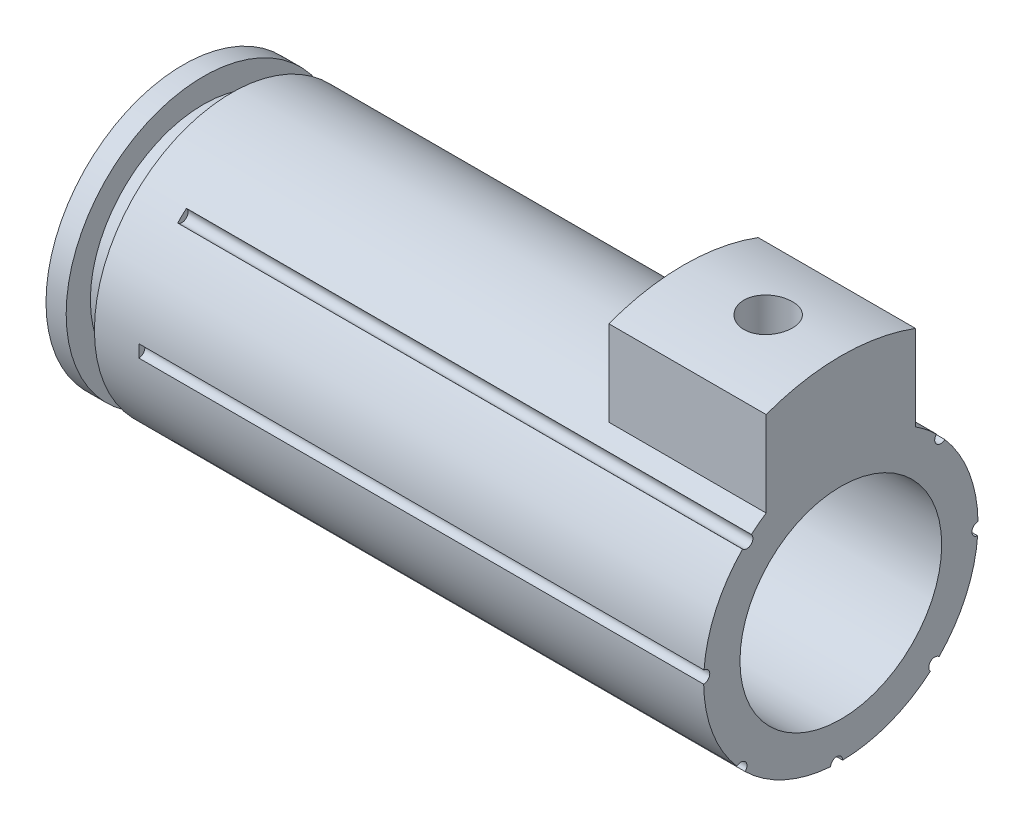
ISO-10303-21;
HEADER;
FILE_DESCRIPTION(('STEP AP214'),'2;1');
FILE_NAME('part.step','',(''),(''),'','','');
FILE_SCHEMA(('AUTOMOTIVE_DESIGN { 1 0 10303 214 1 1 1 1 }'));
ENDSEC;
DATA;
#1=APPLICATION_CONTEXT('core data for automotive mechanical design processes');
#2=APPLICATION_PROTOCOL_DEFINITION('international standard','automotive_design',2000,#1);
#3=PRODUCT_CONTEXT('',#1,'mechanical');
#4=PRODUCT('Part','Part','',(#3));
#5=PRODUCT_RELATED_PRODUCT_CATEGORY('part','',(#4));
#6=PRODUCT_DEFINITION_FORMATION('','',#4);
#7=PRODUCT_DEFINITION_CONTEXT('part definition',#1,'design');
#8=PRODUCT_DEFINITION('design','',#6,#7);
#9=PRODUCT_DEFINITION_SHAPE('','',#8);
#10=(LENGTH_UNIT() NAMED_UNIT(*) SI_UNIT(.MILLI.,.METRE.));
#11=(NAMED_UNIT(*) PLANE_ANGLE_UNIT() SI_UNIT($,.RADIAN.));
#12=(NAMED_UNIT(*) SI_UNIT($,.STERADIAN.) SOLID_ANGLE_UNIT());
#13=UNCERTAINTY_MEASURE_WITH_UNIT(LENGTH_MEASURE(1.E-05),#10,'distance_accuracy_value','');
#14=(GEOMETRIC_REPRESENTATION_CONTEXT(3) GLOBAL_UNCERTAINTY_ASSIGNED_CONTEXT((#13)) GLOBAL_UNIT_ASSIGNED_CONTEXT((#10,
#11,#12)) REPRESENTATION_CONTEXT('',''));
#15=CARTESIAN_POINT('',(0.,0.,0.));
#16=DIRECTION('',(0.,0.,1.));
#17=DIRECTION('',(1.,0.,0.));
#18=AXIS2_PLACEMENT_3D('',#15,#16,#17);
#19=CARTESIAN_POINT('',(20.701,0.,0.));
#20=DIRECTION('',(-1.,0.,0.));
#21=DIRECTION('',(0.,0.,1.));
#22=AXIS2_PLACEMENT_3D('',#19,#20,#21);
#23=PLANE('',#22);
#24=CARTESIAN_POINT('',(20.701,0.,0.));
#25=DIRECTION('',(1.,0.,0.));
#26=DIRECTION('',(0.,0.,-1.));
#27=AXIS2_PLACEMENT_3D('',#24,#25,#26);
#28=CIRCLE('',#27,6.35);
#29=CARTESIAN_POINT('',(20.701,0.,-6.35));
#30=VERTEX_POINT('',#29);
#31=EDGE_CURVE('E242',#30,#30,#28,.T.);
#32=ORIENTED_EDGE('',*,*,#31,.F.);
#33=EDGE_LOOP('',(#32));
#34=FACE_BOUND('',#33,.T.);
#35=CARTESIAN_POINT('',(20.701,0.,0.));
#36=DIRECTION('',(-1.,0.,0.));
#37=DIRECTION('',(0.,0.,1.));
#38=AXIS2_PLACEMENT_3D('',#35,#36,#37);
#39=CIRCLE('',#38,8.63599999999999);
#40=CARTESIAN_POINT('',(20.701,0.645457708168856,8.61184535085049));
#41=VERTEX_POINT('',#40);
#42=CARTESIAN_POINT('',(20.701,6.02400018450176,6.18804636190797));
#43=VERTEX_POINT('',#42);
#44=EDGE_CURVE('E170',#41,#43,#39,.T.);
#45=ORIENTED_EDGE('',*,*,#44,.F.);
#46=CARTESIAN_POINT('',(20.701,0.264987653431793,8.63193359239565));
#47=DIRECTION('',(1.,0.,0.));
#48=DIRECTION('',(0.,0.707106781186539,-0.707106781186556));
#49=AXIS2_PLACEMENT_3D('',#46,#47,#48);
#50=CIRCLE('',#49,0.381000000000001);
#51=CARTESIAN_POINT('',(20.701,-0.115998164471552,8.63522092513208));
#52=VERTEX_POINT('',#51);
#53=EDGE_CURVE('E158',#52,#41,#50,.T.);
#54=ORIENTED_EDGE('',*,*,#53,.F.);
#55=CARTESIAN_POINT('',(20.701,-5.63308672370091,6.54590176853154));
#56=VERTEX_POINT('',#55);
#57=EDGE_CURVE('E176',#56,#52,#39,.T.);
#58=ORIENTED_EDGE('',*,*,#57,.F.);
#59=CARTESIAN_POINT('',(20.701,-5.9163242112626,6.29107334460724));
#60=DIRECTION('',(1.,0.,0.));
#61=DIRECTION('',(0.,1.,0.));
#62=AXIS2_PLACEMENT_3D('',#59,#60,#61);
#63=CIRCLE('',#62,0.381000000000001);
#64=CARTESIAN_POINT('',(20.701,-6.1880463619079,6.02400018450183));
#65=VERTEX_POINT('',#64);
#66=EDGE_CURVE('E218',#65,#56,#63,.T.);
#67=ORIENTED_EDGE('',*,*,#66,.F.);
#68=CARTESIAN_POINT('',(20.701,-8.61184535085049,0.645457708168825));
#69=VERTEX_POINT('',#68);
#70=EDGE_CURVE('E180',#69,#65,#39,.T.);
#71=ORIENTED_EDGE('',*,*,#70,.F.);
#72=CARTESIAN_POINT('',(20.701,-8.63193359239565,0.264987653431762));
#73=DIRECTION('',(1.,0.,0.));
#74=DIRECTION('',(0.,0.707106781186554,0.707106781186541));
#75=AXIS2_PLACEMENT_3D('',#72,#73,#74);
#76=CIRCLE('',#75,0.381000000000001);
#77=CARTESIAN_POINT('',(20.701,-8.63522092513208,-0.115998164471582));
#78=VERTEX_POINT('',#77);
#79=EDGE_CURVE('E217',#78,#69,#76,.T.);
#80=ORIENTED_EDGE('',*,*,#79,.F.);
#81=CARTESIAN_POINT('',(20.701,-6.54590176853148,-5.63308672370098));
#82=VERTEX_POINT('',#81);
#83=EDGE_CURVE('E198',#82,#78,#39,.T.);
#84=ORIENTED_EDGE('',*,*,#83,.F.);
#85=CARTESIAN_POINT('',(20.701,-6.29107334460718,-5.91632421126266));
#86=DIRECTION('',(1.,0.,0.));
#87=DIRECTION('',(0.,0.,1.));
#88=AXIS2_PLACEMENT_3D('',#85,#86,#87);
#89=CIRCLE('',#88,0.381000000000001);
#90=CARTESIAN_POINT('',(20.701,-6.02400018450176,-6.18804636190797));
#91=VERTEX_POINT('',#90);
#92=EDGE_CURVE('E227',#91,#82,#89,.T.);
#93=ORIENTED_EDGE('',*,*,#92,.F.);
#94=CARTESIAN_POINT('',(20.701,-0.645457708168795,-8.61184535085049));
#95=VERTEX_POINT('',#94);
#96=EDGE_CURVE('E193',#95,#91,#39,.T.);
#97=ORIENTED_EDGE('',*,*,#96,.F.);
#98=CARTESIAN_POINT('',(20.701,-0.264987653431732,-8.63193359239565));
#99=DIRECTION('',(1.,0.,0.));
#100=DIRECTION('',(0.,-0.707106781186544,0.707106781186551));
#101=AXIS2_PLACEMENT_3D('',#98,#99,#100);
#102=CIRCLE('',#101,0.381000000000001);
#103=CARTESIAN_POINT('',(20.701,0.115998164471613,-8.63522092513208));
#104=VERTEX_POINT('',#103);
#105=EDGE_CURVE('E231',#104,#95,#102,.T.);
#106=ORIENTED_EDGE('',*,*,#105,.F.);
#107=CARTESIAN_POINT('',(20.701,5.63308672370095,-6.5459017685315));
#108=VERTEX_POINT('',#107);
#109=EDGE_CURVE('E182',#108,#104,#39,.T.);
#110=ORIENTED_EDGE('',*,*,#109,.F.);
#111=CARTESIAN_POINT('',(20.701,5.91632421126264,-6.2910733446072));
#112=DIRECTION('',(1.,0.,0.));
#113=DIRECTION('',(0.,-1.,0.));
#114=AXIS2_PLACEMENT_3D('',#111,#112,#113);
#115=CIRCLE('',#114,0.381000000000001);
#116=CARTESIAN_POINT('',(20.701,6.18804636190795,-6.02400018450179));
#117=VERTEX_POINT('',#116);
#118=EDGE_CURVE('E235',#117,#108,#115,.T.);
#119=ORIENTED_EDGE('',*,*,#118,.F.);
#120=CARTESIAN_POINT('',(20.701,7.24568112740271,-4.699));
#121=VERTEX_POINT('',#120);
#122=EDGE_CURVE('E179',#121,#117,#39,.T.);
#123=ORIENTED_EDGE('',*,*,#122,.F.);
#124=DIRECTION('',(0.,-1.,0.));
#125=VECTOR('',#124,1.);
#126=CARTESIAN_POINT('',(20.701,13.462,-4.699));
#127=LINE('',#126,#125);
#128=CARTESIAN_POINT('',(20.701,12.6152623040506,-4.699));
#129=VERTEX_POINT('',#128);
#130=EDGE_CURVE('E268',#129,#121,#127,.T.);
#131=ORIENTED_EDGE('',*,*,#130,.F.);
#132=CARTESIAN_POINT('',(20.701,0.,0.));
#133=DIRECTION('',(1.,0.,0.));
#134=DIRECTION('',(0.,0.,-1.));
#135=AXIS2_PLACEMENT_3D('',#132,#133,#134);
#136=CIRCLE('',#135,13.462);
#137=CARTESIAN_POINT('',(20.701,12.6152623040506,4.699));
#138=VERTEX_POINT('',#137);
#139=EDGE_CURVE('E252',#129,#138,#136,.T.);
#140=ORIENTED_EDGE('',*,*,#139,.T.);
#141=DIRECTION('',(0.,-1.,0.));
#142=VECTOR('',#141,1.);
#143=CARTESIAN_POINT('',(20.701,13.462,4.699));
#144=LINE('',#143,#142);
#145=CARTESIAN_POINT('',(20.701,7.2456811274027,4.699));
#146=VERTEX_POINT('',#145);
#147=EDGE_CURVE('E261',#138,#146,#144,.T.);
#148=ORIENTED_EDGE('',*,*,#147,.T.);
#149=CARTESIAN_POINT('',(20.701,6.54590176853148,5.63308672370098));
#150=VERTEX_POINT('',#149);
#151=EDGE_CURVE('E177',#150,#146,#39,.T.);
#152=ORIENTED_EDGE('',*,*,#151,.F.);
#153=CARTESIAN_POINT('',(20.701,6.29107334460718,5.91632421126266));
#154=DIRECTION('',(1.,0.,0.));
#155=DIRECTION('',(0.,0.,-1.));
#156=AXIS2_PLACEMENT_3D('',#153,#154,#155);
#157=CIRCLE('',#156,0.381000000000001);
#158=EDGE_CURVE('E175',#43,#150,#157,.T.);
#159=ORIENTED_EDGE('',*,*,#158,.F.);
#160=EDGE_LOOP('',(#45,#54,#58,#67,#71,#80,#84,#93,#97,#106,#110,#119,#123,#131,#140,#148,#152,#159));
#161=FACE_BOUND('',#160,.T.);
#162=ADVANCED_FACE('F35',(#34,#161),#23,.F.);
#163=CARTESIAN_POINT('',(10.795,13.462,-4.699));
#164=DIRECTION('',(0.,0.,1.));
#165=DIRECTION('',(1.,0.,0.));
#166=AXIS2_PLACEMENT_3D('',#163,#164,#165);
#167=PLANE('',#166);
#168=DIRECTION('',(1.,0.,0.));
#169=VECTOR('',#168,1.);
#170=CARTESIAN_POINT('',(7.239,12.6152623040506,-4.699));
#171=LINE('',#170,#169);
#172=CARTESIAN_POINT('',(10.795,12.6152623040506,-4.699));
#173=VERTEX_POINT('',#172);
#174=EDGE_CURVE('E257',#129,#173,#171,.F.);
#175=ORIENTED_EDGE('',*,*,#174,.F.);
#176=ORIENTED_EDGE('',*,*,#130,.T.);
#177=DIRECTION('',(-1.,0.,0.));
#178=VECTOR('',#177,1.);
#179=CARTESIAN_POINT('',(-78.2418042479738,7.2456811274027,-4.699));
#180=LINE('',#179,#178);
#181=CARTESIAN_POINT('',(10.795,7.2456811274027,-4.699));
#182=VERTEX_POINT('',#181);
#183=EDGE_CURVE('E341',#121,#182,#180,.T.);
#184=ORIENTED_EDGE('',*,*,#183,.T.);
#185=DIRECTION('',(0.,-1.,0.));
#186=VECTOR('',#185,1.);
#187=CARTESIAN_POINT('',(10.795,13.462,-4.699));
#188=LINE('',#187,#186);
#189=EDGE_CURVE('E266',#173,#182,#188,.T.);
#190=ORIENTED_EDGE('',*,*,#189,.F.);
#191=EDGE_LOOP('',(#175,#176,#184,#190));
#192=FACE_BOUND('',#191,.T.);
#193=ADVANCED_FACE('F299',(#192),#167,.F.);
#194=CARTESIAN_POINT('',(10.795,13.462,4.699));
#195=DIRECTION('',(1.,0.,0.));
#196=DIRECTION('',(0.,0.,-1.));
#197=AXIS2_PLACEMENT_3D('',#194,#195,#196);
#198=PLANE('',#197);
#199=CARTESIAN_POINT('',(10.795,0.,0.));
#200=DIRECTION('',(1.,0.,0.));
#201=DIRECTION('',(0.,0.,-1.));
#202=AXIS2_PLACEMENT_3D('',#199,#200,#201);
#203=CIRCLE('',#202,13.462);
#204=CARTESIAN_POINT('',(10.795,12.6152623040506,4.699));
#205=VERTEX_POINT('',#204);
#206=EDGE_CURVE('E255',#173,#205,#203,.T.);
#207=ORIENTED_EDGE('',*,*,#206,.F.);
#208=ORIENTED_EDGE('',*,*,#189,.T.);
#209=CARTESIAN_POINT('',(10.795,0.,0.));
#210=DIRECTION('',(1.,0.,0.));
#211=DIRECTION('',(0.,0.,-1.));
#212=AXIS2_PLACEMENT_3D('',#209,#210,#211);
#213=CIRCLE('',#212,8.63599999999998);
#214=CARTESIAN_POINT('',(10.795,7.2456811274027,4.69900000000001));
#215=VERTEX_POINT('',#214);
#216=EDGE_CURVE('E191',#182,#215,#213,.T.);
#217=ORIENTED_EDGE('',*,*,#216,.T.);
#218=DIRECTION('',(0.,-1.,0.));
#219=VECTOR('',#218,1.);
#220=CARTESIAN_POINT('',(10.795,13.462,4.699));
#221=LINE('',#220,#219);
#222=EDGE_CURVE('E264',#205,#215,#221,.T.);
#223=ORIENTED_EDGE('',*,*,#222,.F.);
#224=EDGE_LOOP('',(#207,#208,#217,#223));
#225=FACE_BOUND('',#224,.T.);
#226=ADVANCED_FACE('F295',(#225),#198,.F.);
#227=CARTESIAN_POINT('',(20.701,13.462,4.699));
#228=DIRECTION('',(0.,0.,-1.));
#229=DIRECTION('',(-1.,0.,0.));
#230=AXIS2_PLACEMENT_3D('',#227,#228,#229);
#231=PLANE('',#230);
#232=DIRECTION('',(1.,0.,0.));
#233=VECTOR('',#232,1.);
#234=CARTESIAN_POINT('',(7.239,12.6152623040506,4.699));
#235=LINE('',#234,#233);
#236=EDGE_CURVE('E254',#205,#138,#235,.T.);
#237=ORIENTED_EDGE('',*,*,#236,.F.);
#238=ORIENTED_EDGE('',*,*,#222,.T.);
#239=DIRECTION('',(-1.,0.,0.));
#240=VECTOR('',#239,1.);
#241=CARTESIAN_POINT('',(-78.2418042479738,7.2456811274027,4.69900000000001));
#242=LINE('',#241,#240);
#243=EDGE_CURVE('E186',#215,#146,#242,.F.);
#244=ORIENTED_EDGE('',*,*,#243,.T.);
#245=ORIENTED_EDGE('',*,*,#147,.F.);
#246=EDGE_LOOP('',(#237,#238,#244,#245));
#247=FACE_BOUND('',#246,.T.);
#248=ADVANCED_FACE('F287',(#247),#231,.F.);
#249=CARTESIAN_POINT('',(-78.2418042479738,0.,0.));
#250=DIRECTION('',(-1.,0.,0.));
#251=DIRECTION('',(0.,0.,1.));
#252=AXIS2_PLACEMENT_3D('',#249,#250,#251);
#253=CYLINDRICAL_SURFACE('',#252,8.63599999999998);
#254=CARTESIAN_POINT('',(-17.653,0.,0.));
#255=DIRECTION('',(-1.,0.,0.));
#256=DIRECTION('',(0.,0.,1.));
#257=AXIS2_PLACEMENT_3D('',#254,#255,#256);
#258=CIRCLE('',#257,8.63599999999998);
#259=CARTESIAN_POINT('',(-17.653,0.,8.63599999999998));
#260=VERTEX_POINT('',#259);
#261=EDGE_CURVE('E181',#260,#260,#258,.T.);
#262=ORIENTED_EDGE('',*,*,#261,.F.);
#263=EDGE_LOOP('',(#262));
#264=FACE_BOUND('',#263,.T.);
#265=CARTESIAN_POINT('',(-14.859,0.,0.));
#266=DIRECTION('',(1.,0.,0.));
#267=DIRECTION('',(0.,0.,-1.));
#268=AXIS2_PLACEMENT_3D('',#265,#266,#267);
#269=CIRCLE('',#268,8.63599999999998);
#270=CARTESIAN_POINT('',(-14.859,0.645457708168856,8.61184535085049));
#271=VERTEX_POINT('',#270);
#272=CARTESIAN_POINT('',(-14.859,-0.115998164471552,8.63522092513208));
#273=VERTEX_POINT('',#272);
#274=EDGE_CURVE('E172',#271,#273,#269,.T.);
#275=ORIENTED_EDGE('',*,*,#274,.F.);
#276=DIRECTION('',(1.,0.,0.));
#277=VECTOR('',#276,1.);
#278=CARTESIAN_POINT('',(2.921,0.645457708168856,8.61184535085049));
#279=LINE('',#278,#277);
#280=EDGE_CURVE('E12',#271,#41,#279,.T.);
#281=ORIENTED_EDGE('',*,*,#280,.T.);
#282=ORIENTED_EDGE('',*,*,#44,.T.);
#283=DIRECTION('',(1.,0.,0.));
#284=VECTOR('',#283,1.);
#285=CARTESIAN_POINT('',(2.921,6.02400018450176,6.18804636190797));
#286=LINE('',#285,#284);
#287=CARTESIAN_POINT('',(-14.859,6.02400018450176,6.18804636190797));
#288=VERTEX_POINT('',#287);
#289=EDGE_CURVE('E344',#43,#288,#286,.F.);
#290=ORIENTED_EDGE('',*,*,#289,.T.);
#291=CARTESIAN_POINT('',(-14.859,0.,0.));
#292=DIRECTION('',(1.,0.,0.));
#293=DIRECTION('',(0.,0.,-1.));
#294=AXIS2_PLACEMENT_3D('',#291,#292,#293);
#295=CIRCLE('',#294,8.63599999999998);
#296=CARTESIAN_POINT('',(-14.859,6.54590176853148,5.63308672370098));
#297=VERTEX_POINT('',#296);
#298=EDGE_CURVE('E340',#297,#288,#295,.T.);
#299=ORIENTED_EDGE('',*,*,#298,.F.);
#300=DIRECTION('',(1.,0.,0.));
#301=VECTOR('',#300,1.);
#302=CARTESIAN_POINT('',(2.921,6.54590176853148,5.63308672370098));
#303=LINE('',#302,#301);
#304=EDGE_CURVE('E346',#297,#150,#303,.T.);
#305=ORIENTED_EDGE('',*,*,#304,.T.);
#306=ORIENTED_EDGE('',*,*,#151,.T.);
#307=ORIENTED_EDGE('',*,*,#243,.F.);
#308=ORIENTED_EDGE('',*,*,#216,.F.);
#309=ORIENTED_EDGE('',*,*,#183,.F.);
#310=ORIENTED_EDGE('',*,*,#122,.T.);
#311=DIRECTION('',(1.,0.,0.));
#312=VECTOR('',#311,1.);
#313=CARTESIAN_POINT('',(2.921,6.18804636190795,-6.02400018450179));
#314=LINE('',#313,#312);
#315=CARTESIAN_POINT('',(-14.859,6.18804636190795,-6.02400018450179));
#316=VERTEX_POINT('',#315);
#317=EDGE_CURVE('E351',#117,#316,#314,.F.);
#318=ORIENTED_EDGE('',*,*,#317,.T.);
#319=CARTESIAN_POINT('',(-14.859,0.,0.));
#320=DIRECTION('',(1.,0.,0.));
#321=DIRECTION('',(0.,0.,-1.));
#322=AXIS2_PLACEMENT_3D('',#319,#320,#321);
#323=CIRCLE('',#322,8.63599999999998);
#324=CARTESIAN_POINT('',(-14.859,5.63308672370095,-6.5459017685315));
#325=VERTEX_POINT('',#324);
#326=EDGE_CURVE('E349',#325,#316,#323,.T.);
#327=ORIENTED_EDGE('',*,*,#326,.F.);
#328=DIRECTION('',(1.,0.,0.));
#329=VECTOR('',#328,1.);
#330=CARTESIAN_POINT('',(2.921,5.63308672370095,-6.5459017685315));
#331=LINE('',#330,#329);
#332=EDGE_CURVE('E353',#325,#108,#331,.T.);
#333=ORIENTED_EDGE('',*,*,#332,.T.);
#334=ORIENTED_EDGE('',*,*,#109,.T.);
#335=DIRECTION('',(1.,0.,0.));
#336=VECTOR('',#335,1.);
#337=CARTESIAN_POINT('',(2.921,0.115998164471613,-8.63522092513208));
#338=LINE('',#337,#336);
#339=CARTESIAN_POINT('',(-14.859,0.115998164471613,-8.63522092513208));
#340=VERTEX_POINT('',#339);
#341=EDGE_CURVE('E357',#104,#340,#338,.F.);
#342=ORIENTED_EDGE('',*,*,#341,.T.);
#343=CARTESIAN_POINT('',(-14.859,0.,0.));
#344=DIRECTION('',(1.,0.,0.));
#345=DIRECTION('',(0.,0.,-1.));
#346=AXIS2_PLACEMENT_3D('',#343,#344,#345);
#347=CIRCLE('',#346,8.63599999999998);
#348=CARTESIAN_POINT('',(-14.859,-0.645457708168795,-8.61184535085049));
#349=VERTEX_POINT('',#348);
#350=EDGE_CURVE('E355',#349,#340,#347,.T.);
#351=ORIENTED_EDGE('',*,*,#350,.F.);
#352=DIRECTION('',(1.,0.,0.));
#353=VECTOR('',#352,1.);
#354=CARTESIAN_POINT('',(2.921,-0.645457708168795,-8.61184535085049));
#355=LINE('',#354,#353);
#356=EDGE_CURVE('E359',#349,#95,#355,.T.);
#357=ORIENTED_EDGE('',*,*,#356,.T.);
#358=ORIENTED_EDGE('',*,*,#96,.T.);
#359=DIRECTION('',(1.,0.,0.));
#360=VECTOR('',#359,1.);
#361=CARTESIAN_POINT('',(2.921,-6.02400018450176,-6.18804636190797));
#362=LINE('',#361,#360);
#363=CARTESIAN_POINT('',(-14.859,-6.02400018450176,-6.18804636190797));
#364=VERTEX_POINT('',#363);
#365=EDGE_CURVE('E363',#91,#364,#362,.F.);
#366=ORIENTED_EDGE('',*,*,#365,.T.);
#367=CARTESIAN_POINT('',(-14.859,0.,0.));
#368=DIRECTION('',(1.,0.,0.));
#369=DIRECTION('',(0.,0.,-1.));
#370=AXIS2_PLACEMENT_3D('',#367,#368,#369);
#371=CIRCLE('',#370,8.63599999999998);
#372=CARTESIAN_POINT('',(-14.859,-6.54590176853148,-5.63308672370098));
#373=VERTEX_POINT('',#372);
#374=EDGE_CURVE('E361',#373,#364,#371,.T.);
#375=ORIENTED_EDGE('',*,*,#374,.F.);
#376=DIRECTION('',(1.,0.,0.));
#377=VECTOR('',#376,1.);
#378=CARTESIAN_POINT('',(2.921,-6.54590176853148,-5.63308672370098));
#379=LINE('',#378,#377);
#380=EDGE_CURVE('E365',#373,#82,#379,.T.);
#381=ORIENTED_EDGE('',*,*,#380,.T.);
#382=ORIENTED_EDGE('',*,*,#83,.T.);
#383=DIRECTION('',(1.,0.,0.));
#384=VECTOR('',#383,1.);
#385=CARTESIAN_POINT('',(2.921,-8.63522092513208,-0.115998164471582));
#386=LINE('',#385,#384);
#387=CARTESIAN_POINT('',(-14.859,-8.63522092513208,-0.115998164471582));
#388=VERTEX_POINT('',#387);
#389=EDGE_CURVE('E369',#78,#388,#386,.F.);
#390=ORIENTED_EDGE('',*,*,#389,.T.);
#391=CARTESIAN_POINT('',(-14.859,0.,0.));
#392=DIRECTION('',(1.,0.,0.));
#393=DIRECTION('',(0.,0.,-1.));
#394=AXIS2_PLACEMENT_3D('',#391,#392,#393);
#395=CIRCLE('',#394,8.63599999999998);
#396=CARTESIAN_POINT('',(-14.859,-8.61184535085049,0.645457708168825));
#397=VERTEX_POINT('',#396);
#398=EDGE_CURVE('E367',#397,#388,#395,.T.);
#399=ORIENTED_EDGE('',*,*,#398,.F.);
#400=DIRECTION('',(1.,0.,0.));
#401=VECTOR('',#400,1.);
#402=CARTESIAN_POINT('',(2.921,-8.61184535085049,0.645457708168825));
#403=LINE('',#402,#401);
#404=EDGE_CURVE('E214',#397,#69,#403,.T.);
#405=ORIENTED_EDGE('',*,*,#404,.T.);
#406=ORIENTED_EDGE('',*,*,#70,.T.);
#407=DIRECTION('',(1.,0.,0.));
#408=VECTOR('',#407,1.);
#409=CARTESIAN_POINT('',(2.921,-6.1880463619079,6.02400018450183));
#410=LINE('',#409,#408);
#411=CARTESIAN_POINT('',(-14.859,-6.1880463619079,6.02400018450183));
#412=VERTEX_POINT('',#411);
#413=EDGE_CURVE('E211',#65,#412,#410,.F.);
#414=ORIENTED_EDGE('',*,*,#413,.T.);
#415=CARTESIAN_POINT('',(-14.859,0.,0.));
#416=DIRECTION('',(1.,0.,0.));
#417=DIRECTION('',(0.,0.,-1.));
#418=AXIS2_PLACEMENT_3D('',#415,#416,#417);
#419=CIRCLE('',#418,8.63599999999998);
#420=CARTESIAN_POINT('',(-14.859,-5.63308672370091,6.54590176853154));
#421=VERTEX_POINT('',#420);
#422=EDGE_CURVE('E372',#421,#412,#419,.T.);
#423=ORIENTED_EDGE('',*,*,#422,.F.);
#424=DIRECTION('',(1.,0.,0.));
#425=VECTOR('',#424,1.);
#426=CARTESIAN_POINT('',(2.921,-5.63308672370091,6.54590176853154));
#427=LINE('',#426,#425);
#428=EDGE_CURVE('E375',#421,#56,#427,.T.);
#429=ORIENTED_EDGE('',*,*,#428,.T.);
#430=ORIENTED_EDGE('',*,*,#57,.T.);
#431=DIRECTION('',(1.,0.,0.));
#432=VECTOR('',#431,1.);
#433=CARTESIAN_POINT('',(2.921,-0.115998164471552,8.63522092513208));
#434=LINE('',#433,#432);
#435=EDGE_CURVE('E42',#52,#273,#434,.F.);
#436=ORIENTED_EDGE('',*,*,#435,.T.);
#437=EDGE_LOOP('',(#275,#281,#282,#290,#299,#305,#306,#307,#308,#309,#310,#318,#327,#333,#334,
#342,#351,#357,#358,#366,#375,#381,#382,#390,#399,#405,#406,#414,#423,#429,#430,#436));
#438=FACE_BOUND('',#437,.T.);
#439=ADVANCED_FACE('F168',(#264,#438),#253,.T.);
#440=CARTESIAN_POINT('',(-17.653,8.63599999999998,0.));
#441=DIRECTION('',(1.,0.,0.));
#442=DIRECTION('',(0.,0.,-1.));
#443=AXIS2_PLACEMENT_3D('',#440,#441,#442);
#444=PLANE('',#443);
#445=CARTESIAN_POINT('',(-17.653,0.,0.));
#446=DIRECTION('',(-1.,0.,0.));
#447=DIRECTION('',(0.,0.,1.));
#448=AXIS2_PLACEMENT_3D('',#445,#446,#447);
#449=CIRCLE('',#448,7.11199999999999);
#450=CARTESIAN_POINT('',(-17.653,0.,7.11199999999999));
#451=VERTEX_POINT('',#450);
#452=EDGE_CURVE('E279',#451,#451,#449,.T.);
#453=ORIENTED_EDGE('',*,*,#452,.F.);
#454=EDGE_LOOP('',(#453));
#455=FACE_BOUND('',#454,.T.);
#456=ORIENTED_EDGE('',*,*,#261,.T.);
#457=EDGE_LOOP('',(#456));
#458=FACE_BOUND('',#457,.T.);
#459=ADVANCED_FACE('F284',(#455,#458),#444,.F.);
#460=CARTESIAN_POINT('',(-78.2418042479738,0.,0.));
#461=DIRECTION('',(-1.,0.,0.));
#462=DIRECTION('',(0.,0.,1.));
#463=AXIS2_PLACEMENT_3D('',#460,#461,#462);
#464=CYLINDRICAL_SURFACE('',#463,7.11199999999998);
#465=CARTESIAN_POINT('',(-19.431,0.,0.));
#466=DIRECTION('',(-1.,0.,0.));
#467=DIRECTION('',(0.,0.,1.));
#468=AXIS2_PLACEMENT_3D('',#465,#466,#467);
#469=CIRCLE('',#468,7.11199999999998);
#470=CARTESIAN_POINT('',(-19.431,0.,7.11199999999998));
#471=VERTEX_POINT('',#470);
#472=EDGE_CURVE('E276',#471,#471,#469,.T.);
#473=ORIENTED_EDGE('',*,*,#472,.F.);
#474=EDGE_LOOP('',(#473));
#475=FACE_BOUND('',#474,.T.);
#476=ORIENTED_EDGE('',*,*,#452,.T.);
#477=EDGE_LOOP('',(#476));
#478=FACE_BOUND('',#477,.T.);
#479=ADVANCED_FACE('F292',(#475,#478),#464,.T.);
#480=CARTESIAN_POINT('',(-19.431,7.11199999999998,0.));
#481=DIRECTION('',(-1.,0.,0.));
#482=DIRECTION('',(0.,0.,1.));
#483=AXIS2_PLACEMENT_3D('',#480,#481,#482);
#484=PLANE('',#483);
#485=CARTESIAN_POINT('',(-19.431,0.,0.));
#486=DIRECTION('',(-1.,0.,0.));
#487=DIRECTION('',(0.,0.,1.));
#488=AXIS2_PLACEMENT_3D('',#485,#486,#487);
#489=CIRCLE('',#488,8.63599999999998);
#490=CARTESIAN_POINT('',(-19.431,0.,8.63599999999998));
#491=VERTEX_POINT('',#490);
#492=EDGE_CURVE('E273',#491,#491,#489,.T.);
#493=ORIENTED_EDGE('',*,*,#492,.F.);
#494=EDGE_LOOP('',(#493));
#495=FACE_BOUND('',#494,.T.);
#496=ORIENTED_EDGE('',*,*,#472,.T.);
#497=EDGE_LOOP('',(#496));
#498=FACE_BOUND('',#497,.T.);
#499=ADVANCED_FACE('F465',(#495,#498),#484,.F.);
#500=CARTESIAN_POINT('',(-78.2418042479738,0.,0.));
#501=DIRECTION('',(-1.,0.,0.));
#502=DIRECTION('',(0.,0.,1.));
#503=AXIS2_PLACEMENT_3D('',#500,#501,#502);
#504=CYLINDRICAL_SURFACE('',#503,8.63599999999998);
#505=CARTESIAN_POINT('',(-20.701,0.,0.));
#506=DIRECTION('',(-1.,0.,0.));
#507=DIRECTION('',(0.,0.,1.));
#508=AXIS2_PLACEMENT_3D('',#505,#506,#507);
#509=CIRCLE('',#508,8.63599999999999);
#510=CARTESIAN_POINT('',(-20.701,0.,8.63599999999999));
#511=VERTEX_POINT('',#510);
#512=EDGE_CURVE('E270',#511,#511,#509,.T.);
#513=ORIENTED_EDGE('',*,*,#512,.F.);
#514=EDGE_LOOP('',(#513));
#515=FACE_BOUND('',#514,.T.);
#516=ORIENTED_EDGE('',*,*,#492,.T.);
#517=EDGE_LOOP('',(#516));
#518=FACE_BOUND('',#517,.T.);
#519=ADVANCED_FACE('F456',(#515,#518),#504,.T.);
#520=CARTESIAN_POINT('',(-20.701,8.63599999999999,0.));
#521=DIRECTION('',(1.,0.,0.));
#522=DIRECTION('',(0.,0.,-1.));
#523=AXIS2_PLACEMENT_3D('',#520,#521,#522);
#524=PLANE('',#523);
#525=CARTESIAN_POINT('',(-20.701,0.,0.));
#526=DIRECTION('',(1.,0.,0.));
#527=DIRECTION('',(0.,0.,-1.));
#528=AXIS2_PLACEMENT_3D('',#525,#526,#527);
#529=CIRCLE('',#528,6.35);
#530=CARTESIAN_POINT('',(-20.701,0.,-6.35));
#531=VERTEX_POINT('',#530);
#532=EDGE_CURVE('E244',#531,#531,#529,.T.);
#533=ORIENTED_EDGE('',*,*,#532,.T.);
#534=EDGE_LOOP('',(#533));
#535=FACE_BOUND('',#534,.T.);
#536=ORIENTED_EDGE('',*,*,#512,.T.);
#537=EDGE_LOOP('',(#536));
#538=FACE_BOUND('',#537,.T.);
#539=ADVANCED_FACE('F451',(#535,#538),#524,.F.);
#540=CARTESIAN_POINT('',(7.239,0.,0.));
#541=DIRECTION('',(1.,0.,0.));
#542=DIRECTION('',(0.,0.,-1.));
#543=AXIS2_PLACEMENT_3D('',#540,#541,#542);
#544=CYLINDRICAL_SURFACE('',#543,13.462);
#545=CARTESIAN_POINT('',(16.129,13.3754576744125,1.524));
#546=CARTESIAN_POINT('',(16.2143089531988,13.3754587960841,1.52399633713164));
#547=CARTESIAN_POINT('',(16.2996727686285,13.3762826322088,1.51681284294915));
#548=CARTESIAN_POINT('',(16.4680291824272,13.3794881118573,1.48826751296834));
#549=CARTESIAN_POINT('',(16.5510191355446,13.3818714275764,1.46689045736625));
#550=CARTESIAN_POINT('',(16.7121656596995,13.3879225289008,1.41059238947023));
#551=CARTESIAN_POINT('',(16.7903252988888,13.3915894890777,1.37568007927202));
#552=CARTESIAN_POINT('',(16.9396601772047,13.399793701159,1.29332025003782));
#553=CARTESIAN_POINT('',(17.0108367031556,13.4043307922615,1.2458750464934));
#554=CARTESIAN_POINT('',(17.1445292785702,13.4137875147531,1.13956127643254));
#555=CARTESIAN_POINT('',(17.2070084709769,13.4187086439885,1.08064648953498));
#556=CARTESIAN_POINT('',(17.3212149242968,13.4283654287938,0.95316513782591));
#557=CARTESIAN_POINT('',(17.3729416720929,13.4331010755036,0.884598112662118));
#558=CARTESIAN_POINT('',(17.4643049917635,13.4418684183707,0.739529560236781));
#559=CARTESIAN_POINT('',(17.5039085321188,13.4458981786926,0.663007102973388));
#560=CARTESIAN_POINT('',(17.569689804469,13.4527833130625,0.504344603685502));
#561=CARTESIAN_POINT('',(17.5958679491557,13.4556387232091,0.422204734426195));
#562=CARTESIAN_POINT('',(17.6339460998938,13.4598428954699,0.255014133281343));
#563=CARTESIAN_POINT('',(17.645907075666,13.4611980894657,0.169977451739971));
#564=CARTESIAN_POINT('',(17.6554001642282,13.4622710584081,-0.000906331685698853));
#565=CARTESIAN_POINT('',(17.6529327481981,13.4619888868252,-0.086753407014011));
#566=CARTESIAN_POINT('',(17.6336882684558,13.4598241509078,-0.2564067403687));
#567=CARTESIAN_POINT('',(17.6169767699883,13.4579489195287,-0.340220542413637));
#568=CARTESIAN_POINT('',(17.5698208210961,13.4528170920612,-0.503846202856156));
#569=CARTESIAN_POINT('',(17.5393761500673,13.4495604737828,-0.583657996944227));
#570=CARTESIAN_POINT('',(17.4655472666997,13.4420192544486,-0.737218900946864));
#571=CARTESIAN_POINT('',(17.4221343618541,13.4377323780782,-0.810954099830359));
#572=CARTESIAN_POINT('',(17.323622194652,13.4286109661128,-0.950116970741353));
#573=CARTESIAN_POINT('',(17.2685224925849,13.4237764099148,-1.01554433004202));
#574=CARTESIAN_POINT('',(17.1478328227846,13.4140694360443,-1.1366188973477));
#575=CARTESIAN_POINT('',(17.0821857652322,13.4091969580786,-1.19220920775644));
#576=CARTESIAN_POINT('',(16.9424618829889,13.3999901970635,-1.29159031858122));
#577=CARTESIAN_POINT('',(16.8683850396986,13.3956559152015,-1.33538109296214));
#578=CARTESIAN_POINT('',(16.7138571425113,13.3880161512133,-1.4099215576248));
#579=CARTESIAN_POINT('',(16.6334041249118,13.3847109875865,-1.44066721166717));
#580=CARTESIAN_POINT('',(16.4684316172957,13.3795101064775,-1.48819694363694));
#581=CARTESIAN_POINT('',(16.3839122871644,13.3776143336267,-1.50498157003115));
#582=CARTESIAN_POINT('',(16.213707355721,13.3754567660083,-1.52403852268642));
#583=CARTESIAN_POINT('',(16.1280308026967,13.3751859824708,-1.52639068500703));
#584=CARTESIAN_POINT('',(15.9575040287331,13.3762853088206,-1.51672609974462));
#585=CARTESIAN_POINT('',(15.87265379344,13.3776553901532,-1.50470960220793));
#586=CARTESIAN_POINT('',(15.7064242203451,13.3818738851972,-1.46671581135876));
#587=CARTESIAN_POINT('',(15.6250360390123,13.3847182526718,-1.44077672226105));
#588=CARTESIAN_POINT('',(15.4677651095766,13.3915615556251,-1.3757132274284));
#589=CARTESIAN_POINT('',(15.391882521719,13.3955605246927,-1.33658843809885));
#590=CARTESIAN_POINT('',(15.247414256863,13.4042841008507,-1.24606601381195));
#591=CARTESIAN_POINT('',(15.1788617457005,13.4090117877876,-1.19461574973268));
#592=CARTESIAN_POINT('',(15.0513369516996,13.4186502446583,-1.08097777223077));
#593=CARTESIAN_POINT('',(14.9923649736389,13.4235610204105,-1.0187897173454));
#594=CARTESIAN_POINT('',(14.8853973549763,13.4330397182363,-0.885093887572723));
#595=CARTESIAN_POINT('',(14.8374539866931,13.437605941299,-0.813544153092107));
#596=CARTESIAN_POINT('',(14.7542652168428,13.4458559877061,-0.663361637545811));
#597=CARTESIAN_POINT('',(14.7190195994768,13.4495398260462,-0.584728976883174));
#598=CARTESIAN_POINT('',(14.6623142719299,13.455602434034,-0.422790761418786));
#599=CARTESIAN_POINT('',(14.6408236747876,13.4579841258903,-0.339496136082089));
#600=CARTESIAN_POINT('',(14.6121377778348,13.4611861561194,-0.17045222289065));
#601=CARTESIAN_POINT('',(14.6049419549117,13.4620065516272,-0.0847030249766807));
#602=CARTESIAN_POINT('',(14.6050584285613,13.4619934048517,0.0863040400723787));
#603=CARTESIAN_POINT('',(14.6122898549786,13.4611690818319,0.171561974421164));
#604=CARTESIAN_POINT('',(14.640885121375,13.4579773649454,0.339643050269887));
#605=CARTESIAN_POINT('',(14.6622489629197,13.4556099709077,0.422466191500107));
#606=CARTESIAN_POINT('',(14.7184786764052,13.4495971131306,0.583320944378217));
#607=CARTESIAN_POINT('',(14.7533414124398,13.4459519462471,0.661353664007011));
#608=CARTESIAN_POINT('',(14.8355708673575,13.437788516371,0.810473344125017));
#609=CARTESIAN_POINT('',(14.8829376253591,13.4332702506471,0.881560282883621));
#610=CARTESIAN_POINT('',(14.9891320564982,13.4238356151336,1.01518448868966));
#611=CARTESIAN_POINT('',(15.0480199843127,13.4189172354091,1.07767372988954));
#612=CARTESIAN_POINT('',(15.1754622203698,13.4092533072216,1.19191683682008));
#613=CARTESIAN_POINT('',(15.2440188285203,13.4045078002192,1.24366814103741));
#614=CARTESIAN_POINT('',(15.3890985071423,13.3957107743966,1.33510296517971));
#615=CARTESIAN_POINT('',(15.4656462897747,13.3916615173804,1.37474746754024));
#616=CARTESIAN_POINT('',(15.6243126265382,13.3847421243418,1.44056495798047));
#617=CARTESIAN_POINT('',(15.7064248945759,13.3818706828084,1.46675286976383));
#618=CARTESIAN_POINT('',(15.8456522489198,13.3783427633618,1.49851330273761));
#619=CARTESIAN_POINT('',(15.9018828724095,13.3772661062514,1.50805741437993));
#620=CARTESIAN_POINT('',(16.0150675087071,13.3758231892471,1.52080196787275));
#621=CARTESIAN_POINT('',(16.0720215173242,13.3754569252397,1.52400244645695));
#622=CARTESIAN_POINT('',(16.129,13.3754576744125,1.524));
#623=B_SPLINE_CURVE_WITH_KNOTS('',3,(#545,#546,#547,#548,#549,#550,#551,#552,#553,#554,#555,
#556,#557,#558,#559,#560,#561,#562,#563,#564,#565,#566,#567,#568,#569,#570,#571,#572,#573,#574,
#575,#576,#577,#578,#579,#580,#581,#582,#583,#584,#585,#586,#587,#588,#589,#590,#591,#592,#593,
#594,#595,#596,#597,#598,#599,#600,#601,#602,#603,#604,#605,#606,#607,#608,#609,#610,#611,#612,
#613,#614,#615,#616,#617,#618,#619,#620,#621,#622),.UNSPECIFIED.,.T.,.F.,(4,2,2,2,2,2,2,2,2,2,2,
2,2,2,2,2,2,2,2,2,2,2,2,2,2,2,2,2,2,2,2,2,2,2,2,2,2,2,4),(0.,0.255718747180567,
0.511712146241649,0.767541234046053,1.02332308963716,1.28015787340634,1.53700491076496,
1.79454566262074,2.05207849729257,2.30850288229059,2.56491889342641,2.82016096111878,
3.07540712906171,3.33122227124861,3.58704704007264,3.84430629996732,4.10156612748791,
4.35890549481736,4.61623475194792,4.8721392480575,5.12803929093029,5.38324069595282,
5.6384495258626,5.89476814165785,6.15109490991028,6.40861264630667,6.66612600597099,
6.9230590705053,7.17998273248534,7.43547028694226,7.69095786970123,7.9463861361291,
8.20181520166564,8.45861768153503,8.71548135086967,8.97316430562897,9.23056086323537,
9.40135830046625,9.57215474866745),.UNSPECIFIED.);
#624=CARTESIAN_POINT('',(16.129,13.3754576744125,1.524));
#625=VERTEX_POINT('',#624);
#626=EDGE_CURVE('E334',#625,#625,#623,.T.);
#627=ORIENTED_EDGE('',*,*,#626,.F.);
#628=EDGE_LOOP('',(#627));
#629=FACE_BOUND('',#628,.T.);
#630=ORIENTED_EDGE('',*,*,#174,.T.);
#631=ORIENTED_EDGE('',*,*,#206,.T.);
#632=ORIENTED_EDGE('',*,*,#236,.T.);
#633=ORIENTED_EDGE('',*,*,#139,.F.);
#634=EDGE_LOOP('',(#630,#631,#632,#633));
#635=FACE_BOUND('',#634,.T.);
#636=ADVANCED_FACE('F330',(#629,#635),#544,.T.);
#637=CARTESIAN_POINT('',(16.129,7.112,0.));
#638=DIRECTION('',(0.,1.,0.));
#639=DIRECTION('',(0.,0.,1.));
#640=AXIS2_PLACEMENT_3D('',#637,#638,#639);
#641=CYLINDRICAL_SURFACE('',#640,1.524);
#642=ORIENTED_EDGE('',*,*,#626,.T.);
#643=EDGE_LOOP('',(#642));
#644=FACE_BOUND('',#643,.T.);
#645=CARTESIAN_POINT('',(16.129,7.112,0.));
#646=DIRECTION('',(0.,1.,0.));
#647=DIRECTION('',(0.,0.,1.));
#648=AXIS2_PLACEMENT_3D('',#645,#646,#647);
#649=CIRCLE('',#648,1.524);
#650=CARTESIAN_POINT('',(16.129,7.112,1.524));
#651=VERTEX_POINT('',#650);
#652=EDGE_CURVE('E247',#651,#651,#649,.T.);
#653=ORIENTED_EDGE('',*,*,#652,.F.);
#654=EDGE_LOOP('',(#653));
#655=FACE_BOUND('',#654,.T.);
#656=ADVANCED_FACE('F321',(#644,#655),#641,.F.);
#657=CARTESIAN_POINT('',(16.129,7.112,0.));
#658=DIRECTION('',(0.,1.,0.));
#659=DIRECTION('',(0.,0.,1.));
#660=AXIS2_PLACEMENT_3D('',#657,#658,#659);
#661=PLANE('',#660);
#662=ORIENTED_EDGE('',*,*,#652,.T.);
#663=EDGE_LOOP('',(#662));
#664=FACE_BOUND('',#663,.T.);
#665=ADVANCED_FACE('F311',(#664),#661,.T.);
#666=CARTESIAN_POINT('',(-20.701,0.,0.));
#667=DIRECTION('',(1.,0.,0.));
#668=DIRECTION('',(0.,0.,-1.));
#669=AXIS2_PLACEMENT_3D('',#666,#667,#668);
#670=CYLINDRICAL_SURFACE('',#669,6.35);
#671=ORIENTED_EDGE('',*,*,#532,.F.);
#672=EDGE_LOOP('',(#671));
#673=FACE_BOUND('',#672,.T.);
#674=ORIENTED_EDGE('',*,*,#31,.T.);
#675=EDGE_LOOP('',(#674));
#676=FACE_BOUND('',#675,.T.);
#677=ADVANCED_FACE('F308',(#673,#676),#670,.F.);
#678=CARTESIAN_POINT('',(-14.859,6.29107334460718,5.91632421126266));
#679=DIRECTION('',(1.,0.,0.));
#680=DIRECTION('',(0.,0.,-1.));
#681=AXIS2_PLACEMENT_3D('',#678,#679,#680);
#682=CYLINDRICAL_SURFACE('',#681,0.381000000000001);
#683=CARTESIAN_POINT('',(-14.859,6.29107334460718,5.91632421126266));
#684=DIRECTION('',(1.,0.,0.));
#685=DIRECTION('',(0.,0.,-1.));
#686=AXIS2_PLACEMENT_3D('',#683,#684,#685);
#687=CIRCLE('',#686,0.381000000000001);
#688=EDGE_CURVE('E240',#288,#297,#687,.T.);
#689=ORIENTED_EDGE('',*,*,#688,.F.);
#690=ORIENTED_EDGE('',*,*,#289,.F.);
#691=ORIENTED_EDGE('',*,*,#158,.T.);
#692=ORIENTED_EDGE('',*,*,#304,.F.);
#693=EDGE_LOOP('',(#689,#690,#691,#692));
#694=FACE_BOUND('',#693,.T.);
#695=ADVANCED_FACE('F310',(#694),#682,.F.);
#696=CARTESIAN_POINT('',(-14.859,6.29107334460718,5.91632421126266));
#697=DIRECTION('',(1.,0.,0.));
#698=DIRECTION('',(0.,0.,-1.));
#699=AXIS2_PLACEMENT_3D('',#696,#697,#698);
#700=PLANE('',#699);
#701=ORIENTED_EDGE('',*,*,#298,.T.);
#702=ORIENTED_EDGE('',*,*,#688,.T.);
#703=EDGE_LOOP('',(#701,#702));
#704=FACE_BOUND('',#703,.T.);
#705=ADVANCED_FACE('F318',(#704),#700,.T.);
#706=CARTESIAN_POINT('',(-14.859,5.91632421126264,-6.2910733446072));
#707=DIRECTION('',(1.,0.,0.));
#708=DIRECTION('',(0.,0.,-1.));
#709=AXIS2_PLACEMENT_3D('',#706,#707,#708);
#710=CYLINDRICAL_SURFACE('',#709,0.381000000000001);
#711=CARTESIAN_POINT('',(-14.859,5.91632421126264,-6.2910733446072));
#712=DIRECTION('',(1.,0.,0.));
#713=DIRECTION('',(0.,-1.,0.));
#714=AXIS2_PLACEMENT_3D('',#711,#712,#713);
#715=CIRCLE('',#714,0.381000000000001);
#716=EDGE_CURVE('E237',#316,#325,#715,.T.);
#717=ORIENTED_EDGE('',*,*,#716,.F.);
#718=ORIENTED_EDGE('',*,*,#317,.F.);
#719=ORIENTED_EDGE('',*,*,#118,.T.);
#720=ORIENTED_EDGE('',*,*,#332,.F.);
#721=EDGE_LOOP('',(#717,#718,#719,#720));
#722=FACE_BOUND('',#721,.T.);
#723=ADVANCED_FACE('F414',(#722),#710,.F.);
#724=CARTESIAN_POINT('',(-14.859,5.91632421126264,-6.2910733446072));
#725=DIRECTION('',(1.,0.,0.));
#726=DIRECTION('',(0.,-1.,0.));
#727=AXIS2_PLACEMENT_3D('',#724,#725,#726);
#728=PLANE('',#727);
#729=ORIENTED_EDGE('',*,*,#326,.T.);
#730=ORIENTED_EDGE('',*,*,#716,.T.);
#731=EDGE_LOOP('',(#729,#730));
#732=FACE_BOUND('',#731,.T.);
#733=ADVANCED_FACE('F410',(#732),#728,.T.);
#734=CARTESIAN_POINT('',(-14.859,-0.264987653431732,-8.63193359239565));
#735=DIRECTION('',(1.,0.,0.));
#736=DIRECTION('',(0.,0.,-1.));
#737=AXIS2_PLACEMENT_3D('',#734,#735,#736);
#738=CYLINDRICAL_SURFACE('',#737,0.381000000000001);
#739=CARTESIAN_POINT('',(-14.859,-0.264987653431732,-8.63193359239565));
#740=DIRECTION('',(1.,0.,0.));
#741=DIRECTION('',(0.,-0.707106781186544,0.707106781186551));
#742=AXIS2_PLACEMENT_3D('',#739,#740,#741);
#743=CIRCLE('',#742,0.381000000000001);
#744=EDGE_CURVE('E233',#340,#349,#743,.T.);
#745=ORIENTED_EDGE('',*,*,#744,.F.);
#746=ORIENTED_EDGE('',*,*,#341,.F.);
#747=ORIENTED_EDGE('',*,*,#105,.T.);
#748=ORIENTED_EDGE('',*,*,#356,.F.);
#749=EDGE_LOOP('',(#745,#746,#747,#748));
#750=FACE_BOUND('',#749,.T.);
#751=ADVANCED_FACE('F406',(#750),#738,.F.);
#752=CARTESIAN_POINT('',(-14.859,-0.264987653431732,-8.63193359239565));
#753=DIRECTION('',(1.,0.,0.));
#754=DIRECTION('',(0.,-0.707106781186544,0.707106781186551));
#755=AXIS2_PLACEMENT_3D('',#752,#753,#754);
#756=PLANE('',#755);
#757=ORIENTED_EDGE('',*,*,#350,.T.);
#758=ORIENTED_EDGE('',*,*,#744,.T.);
#759=EDGE_LOOP('',(#757,#758));
#760=FACE_BOUND('',#759,.T.);
#761=ADVANCED_FACE('F402',(#760),#756,.T.);
#762=CARTESIAN_POINT('',(-14.859,-6.29107334460718,-5.91632421126266));
#763=DIRECTION('',(1.,0.,0.));
#764=DIRECTION('',(0.,0.,-1.));
#765=AXIS2_PLACEMENT_3D('',#762,#763,#764);
#766=CYLINDRICAL_SURFACE('',#765,0.381000000000001);
#767=CARTESIAN_POINT('',(-14.859,-6.29107334460718,-5.91632421126266));
#768=DIRECTION('',(1.,0.,0.));
#769=DIRECTION('',(0.,0.,1.));
#770=AXIS2_PLACEMENT_3D('',#767,#768,#769);
#771=CIRCLE('',#770,0.381000000000001);
#772=EDGE_CURVE('E229',#364,#373,#771,.T.);
#773=ORIENTED_EDGE('',*,*,#772,.F.);
#774=ORIENTED_EDGE('',*,*,#365,.F.);
#775=ORIENTED_EDGE('',*,*,#92,.T.);
#776=ORIENTED_EDGE('',*,*,#380,.F.);
#777=EDGE_LOOP('',(#773,#774,#775,#776));
#778=FACE_BOUND('',#777,.T.);
#779=ADVANCED_FACE('F398',(#778),#766,.F.);
#780=CARTESIAN_POINT('',(-14.859,-6.29107334460718,-5.91632421126266));
#781=DIRECTION('',(1.,0.,0.));
#782=DIRECTION('',(0.,0.,1.));
#783=AXIS2_PLACEMENT_3D('',#780,#781,#782);
#784=PLANE('',#783);
#785=ORIENTED_EDGE('',*,*,#374,.T.);
#786=ORIENTED_EDGE('',*,*,#772,.T.);
#787=EDGE_LOOP('',(#785,#786));
#788=FACE_BOUND('',#787,.T.);
#789=ADVANCED_FACE('F394',(#788),#784,.T.);
#790=CARTESIAN_POINT('',(-14.859,-8.63193359239565,0.264987653431762));
#791=DIRECTION('',(1.,0.,0.));
#792=DIRECTION('',(0.,0.,-1.));
#793=AXIS2_PLACEMENT_3D('',#790,#791,#792);
#794=CYLINDRICAL_SURFACE('',#793,0.381000000000001);
#795=CARTESIAN_POINT('',(-14.859,-8.63193359239565,0.264987653431762));
#796=DIRECTION('',(1.,0.,0.));
#797=DIRECTION('',(0.,0.707106781186554,0.707106781186541));
#798=AXIS2_PLACEMENT_3D('',#795,#796,#797);
#799=CIRCLE('',#798,0.381000000000001);
#800=EDGE_CURVE('E225',#388,#397,#799,.T.);
#801=ORIENTED_EDGE('',*,*,#800,.F.);
#802=ORIENTED_EDGE('',*,*,#389,.F.);
#803=ORIENTED_EDGE('',*,*,#79,.T.);
#804=ORIENTED_EDGE('',*,*,#404,.F.);
#805=EDGE_LOOP('',(#801,#802,#803,#804));
#806=FACE_BOUND('',#805,.T.);
#807=ADVANCED_FACE('F387',(#806),#794,.F.);
#808=CARTESIAN_POINT('',(-14.859,-8.63193359239565,0.264987653431762));
#809=DIRECTION('',(1.,0.,0.));
#810=DIRECTION('',(0.,0.707106781186554,0.707106781186541));
#811=AXIS2_PLACEMENT_3D('',#808,#809,#810);
#812=PLANE('',#811);
#813=ORIENTED_EDGE('',*,*,#398,.T.);
#814=ORIENTED_EDGE('',*,*,#800,.T.);
#815=EDGE_LOOP('',(#813,#814));
#816=FACE_BOUND('',#815,.T.);
#817=ADVANCED_FACE('F380',(#816),#812,.T.);
#818=CARTESIAN_POINT('',(-14.859,-5.9163242112626,6.29107334460724));
#819=DIRECTION('',(1.,0.,0.));
#820=DIRECTION('',(0.,0.,-1.));
#821=AXIS2_PLACEMENT_3D('',#818,#819,#820);
#822=CYLINDRICAL_SURFACE('',#821,0.381000000000001);
#823=CARTESIAN_POINT('',(-14.859,-5.9163242112626,6.29107334460724));
#824=DIRECTION('',(1.,0.,0.));
#825=DIRECTION('',(0.,1.,0.));
#826=AXIS2_PLACEMENT_3D('',#823,#824,#825);
#827=CIRCLE('',#826,0.381000000000001);
#828=EDGE_CURVE('E55',#412,#421,#827,.T.);
#829=ORIENTED_EDGE('',*,*,#828,.F.);
#830=ORIENTED_EDGE('',*,*,#413,.F.);
#831=ORIENTED_EDGE('',*,*,#66,.T.);
#832=ORIENTED_EDGE('',*,*,#428,.F.);
#833=EDGE_LOOP('',(#829,#830,#831,#832));
#834=FACE_BOUND('',#833,.T.);
#835=ADVANCED_FACE('F377',(#834),#822,.F.);
#836=CARTESIAN_POINT('',(-14.859,-5.9163242112626,6.29107334460724));
#837=DIRECTION('',(1.,0.,0.));
#838=DIRECTION('',(0.,1.,0.));
#839=AXIS2_PLACEMENT_3D('',#836,#837,#838);
#840=PLANE('',#839);
#841=ORIENTED_EDGE('',*,*,#422,.T.);
#842=ORIENTED_EDGE('',*,*,#828,.T.);
#843=EDGE_LOOP('',(#841,#842));
#844=FACE_BOUND('',#843,.T.);
#845=ADVANCED_FACE('F379',(#844),#840,.T.);
#846=CARTESIAN_POINT('',(-14.859,0.264987653431793,8.63193359239565));
#847=DIRECTION('',(1.,0.,0.));
#848=DIRECTION('',(0.,0.,-1.));
#849=AXIS2_PLACEMENT_3D('',#846,#847,#848);
#850=CYLINDRICAL_SURFACE('',#849,0.381000000000001);
#851=CARTESIAN_POINT('',(-14.859,0.264987653431793,8.63193359239565));
#852=DIRECTION('',(1.,0.,0.));
#853=DIRECTION('',(0.,0.707106781186539,-0.707106781186556));
#854=AXIS2_PLACEMENT_3D('',#851,#852,#853);
#855=CIRCLE('',#854,0.381000000000001);
#856=EDGE_CURVE('E48',#273,#271,#855,.T.);
#857=ORIENTED_EDGE('',*,*,#856,.F.);
#858=ORIENTED_EDGE('',*,*,#435,.F.);
#859=ORIENTED_EDGE('',*,*,#53,.T.);
#860=ORIENTED_EDGE('',*,*,#280,.F.);
#861=EDGE_LOOP('',(#857,#858,#859,#860));
#862=FACE_BOUND('',#861,.T.);
#863=ADVANCED_FACE('F159',(#862),#850,.F.);
#864=CARTESIAN_POINT('',(-14.859,0.264987653431793,8.63193359239565));
#865=DIRECTION('',(1.,0.,0.));
#866=DIRECTION('',(0.,0.707106781186539,-0.707106781186556));
#867=AXIS2_PLACEMENT_3D('',#864,#865,#866);
#868=PLANE('',#867);
#869=ORIENTED_EDGE('',*,*,#274,.T.);
#870=ORIENTED_EDGE('',*,*,#856,.T.);
#871=EDGE_LOOP('',(#869,#870));
#872=FACE_BOUND('',#871,.T.);
#873=ADVANCED_FACE('F622',(#872),#868,.T.);
#874=CLOSED_SHELL('',(#162,#193,#226,#248,#439,#459,#479,#499,#519,#539,#636,#656,#665,#677,
#695,#705,#723,#733,#751,#761,#779,#789,#807,#817,#835,#845,#863,#873));
#875=MANIFOLD_SOLID_BREP('B2',#874);
#876=ADVANCED_BREP_SHAPE_REPRESENTATION('',(#18,#875),#14);
#877=SHAPE_DEFINITION_REPRESENTATION(#9,#876);
ENDSEC;
END-ISO-10303-21;
